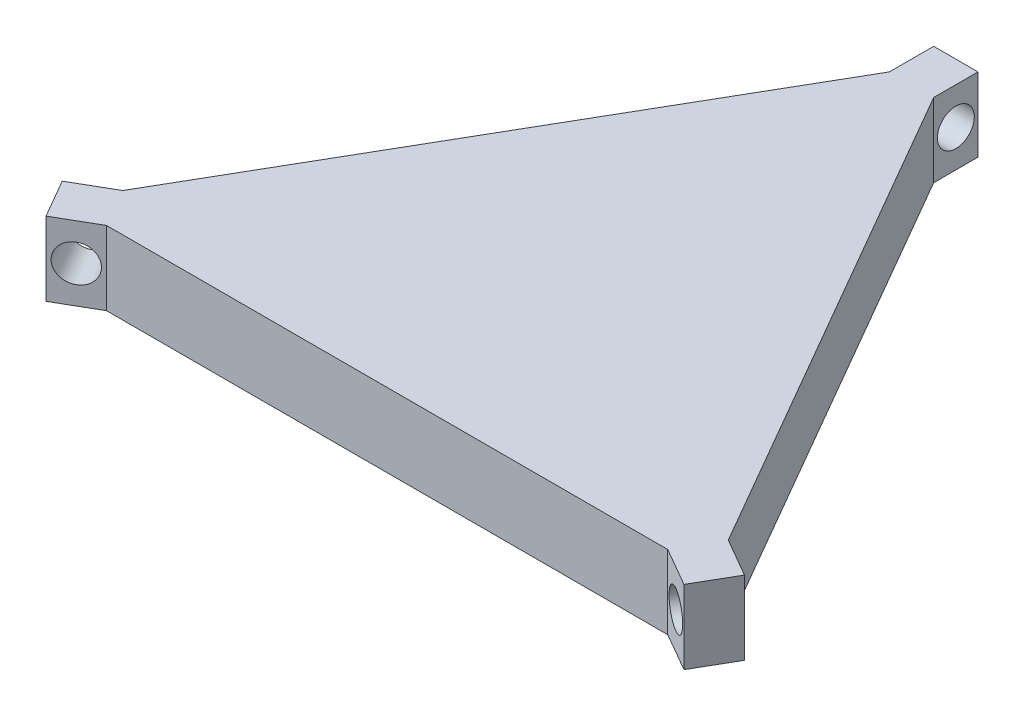
ISO-10303-21;
HEADER;
FILE_DESCRIPTION(('STEP AP214'),'2;1');
FILE_NAME('part.step','',(''),(''),'','','');
FILE_SCHEMA(('AUTOMOTIVE_DESIGN { 1 0 10303 214 1 1 1 1 }'));
ENDSEC;
DATA;
#1=APPLICATION_CONTEXT('core data for automotive mechanical design processes');
#2=APPLICATION_PROTOCOL_DEFINITION('international standard','automotive_design',2000,#1);
#3=PRODUCT_CONTEXT('',#1,'mechanical');
#4=PRODUCT('Part','Part','',(#3));
#5=PRODUCT_RELATED_PRODUCT_CATEGORY('part','',(#4));
#6=PRODUCT_DEFINITION_FORMATION('','',#4);
#7=PRODUCT_DEFINITION_CONTEXT('part definition',#1,'design');
#8=PRODUCT_DEFINITION('design','',#6,#7);
#9=PRODUCT_DEFINITION_SHAPE('','',#8);
#10=(LENGTH_UNIT() NAMED_UNIT(*) SI_UNIT(.MILLI.,.METRE.));
#11=(NAMED_UNIT(*) PLANE_ANGLE_UNIT() SI_UNIT($,.RADIAN.));
#12=(NAMED_UNIT(*) SI_UNIT($,.STERADIAN.) SOLID_ANGLE_UNIT());
#13=UNCERTAINTY_MEASURE_WITH_UNIT(LENGTH_MEASURE(1.E-05),#10,'distance_accuracy_value','');
#14=(GEOMETRIC_REPRESENTATION_CONTEXT(3) GLOBAL_UNCERTAINTY_ASSIGNED_CONTEXT((#13)) GLOBAL_UNIT_ASSIGNED_CONTEXT((#10,
#11,#12)) REPRESENTATION_CONTEXT('',''));
#15=CARTESIAN_POINT('',(0.,0.,0.));
#16=DIRECTION('',(0.,0.,1.));
#17=DIRECTION('',(1.,0.,0.));
#18=AXIS2_PLACEMENT_3D('',#15,#16,#17);
#19=CARTESIAN_POINT('',(-46.1961524226872,10.,-2.1961524227179));
#20=DIRECTION('',(0.866025403786309,0.,-0.499999999996761));
#21=DIRECTION('',(-0.499999999996761,0.,-0.866025403786309));
#22=AXIS2_PLACEMENT_3D('',#19,#20,#21);
#23=PLANE('',#22);
#24=DIRECTION('',(0.499999999996761,0.,0.866025403786309));
#25=VECTOR('',#24,1.);
#26=CARTESIAN_POINT('',(-46.1961524226872,0.,-2.1961524227179));
#27=LINE('',#26,#25);
#28=CARTESIAN_POINT('',(-46.1961524226872,0.,-2.1961524227179));
#29=VERTEX_POINT('',#28);
#30=CARTESIAN_POINT('',(-43.1961524227067,0.,2.99999999999995));
#31=VERTEX_POINT('',#30);
#32=EDGE_CURVE('E171',#29,#31,#27,.T.);
#33=ORIENTED_EDGE('',*,*,#32,.T.);
#34=DIRECTION('',(0.,-1.,0.));
#35=VECTOR('',#34,1.);
#36=CARTESIAN_POINT('',(-43.1961524227067,10.,2.99999999999995));
#37=LINE('',#36,#35);
#38=CARTESIAN_POINT('',(-43.1961524227067,10.,2.99999999999995));
#39=VERTEX_POINT('',#38);
#40=EDGE_CURVE('E11',#39,#31,#37,.T.);
#41=ORIENTED_EDGE('',*,*,#40,.F.);
#42=DIRECTION('',(0.499999999996761,0.,0.866025403786309));
#43=VECTOR('',#42,1.);
#44=CARTESIAN_POINT('',(-46.1961524226872,10.,-2.1961524227179));
#45=LINE('',#44,#43);
#46=CARTESIAN_POINT('',(-46.1961524226872,10.,-2.1961524227179));
#47=VERTEX_POINT('',#46);
#48=EDGE_CURVE('E206',#47,#39,#45,.T.);
#49=ORIENTED_EDGE('',*,*,#48,.F.);
#50=DIRECTION('',(0.,-1.,0.));
#51=VECTOR('',#50,1.);
#52=CARTESIAN_POINT('',(-46.1961524226872,10.,-2.1961524227179));
#53=LINE('',#52,#51);
#54=EDGE_CURVE('E167',#47,#29,#53,.T.);
#55=ORIENTED_EDGE('',*,*,#54,.T.);
#56=EDGE_LOOP('',(#33,#41,#49,#55));
#57=FACE_BOUND('',#56,.T.);
#58=ADVANCED_FACE('F45',(#57),#23,.F.);
#59=CARTESIAN_POINT('',(-38.,10.,0.));
#60=DIRECTION('',(-0.499999999999992,0.,-0.866025403784443));
#61=DIRECTION('',(-0.866025403784443,0.,0.499999999999992));
#62=AXIS2_PLACEMENT_3D('',#59,#60,#61);
#63=PLANE('',#62);
#64=CARTESIAN_POINT('',(-40.5980762113533,5.,1.49999999999998));
#65=DIRECTION('',(0.499999999999992,0.,0.866025403784443));
#66=DIRECTION('',(0.866025403784443,0.,-0.499999999999992));
#67=AXIS2_PLACEMENT_3D('',#64,#65,#66);
#68=CIRCLE('',#67,2.5);
#69=CARTESIAN_POINT('',(-38.4330127018922,5.,0.249999999999997));
#70=VERTEX_POINT('',#69);
#71=EDGE_CURVE('E354',#70,#70,#68,.T.);
#72=ORIENTED_EDGE('',*,*,#71,.F.);
#73=EDGE_LOOP('',(#72));
#74=FACE_BOUND('',#73,.T.);
#75=DIRECTION('',(0.866025403784443,0.,-0.499999999999992));
#76=VECTOR('',#75,1.);
#77=CARTESIAN_POINT('',(-38.,0.,0.));
#78=LINE('',#77,#76);
#79=CARTESIAN_POINT('',(-38.,0.,0.));
#80=VERTEX_POINT('',#79);
#81=EDGE_CURVE('E175',#31,#80,#78,.T.);
#82=ORIENTED_EDGE('',*,*,#81,.T.);
#83=DIRECTION('',(0.,-1.,0.));
#84=VECTOR('',#83,1.);
#85=CARTESIAN_POINT('',(-38.,10.,0.));
#86=LINE('',#85,#84);
#87=CARTESIAN_POINT('',(-38.,10.,0.));
#88=VERTEX_POINT('',#87);
#89=EDGE_CURVE('E55',#88,#80,#86,.T.);
#90=ORIENTED_EDGE('',*,*,#89,.F.);
#91=DIRECTION('',(0.866025403784443,0.,-0.499999999999992));
#92=VECTOR('',#91,1.);
#93=CARTESIAN_POINT('',(-38.,10.,0.));
#94=LINE('',#93,#92);
#95=EDGE_CURVE('E118',#39,#88,#94,.T.);
#96=ORIENTED_EDGE('',*,*,#95,.F.);
#97=ORIENTED_EDGE('',*,*,#40,.T.);
#98=EDGE_LOOP('',(#82,#90,#96,#97));
#99=FACE_BOUND('',#98,.T.);
#100=ADVANCED_FACE('F305',(#74,#99),#63,.F.);
#101=CARTESIAN_POINT('',(-38.,10.,0.));
#102=DIRECTION('',(0.,0.,-1.));
#103=DIRECTION('',(-1.,0.,0.));
#104=AXIS2_PLACEMENT_3D('',#101,#102,#103);
#105=PLANE('',#104);
#106=DIRECTION('',(1.,0.,0.));
#107=VECTOR('',#106,1.);
#108=CARTESIAN_POINT('',(-38.,0.,0.));
#109=LINE('',#108,#107);
#110=CARTESIAN_POINT('',(38.,0.,0.));
#111=VERTEX_POINT('',#110);
#112=EDGE_CURVE('E179',#80,#111,#109,.T.);
#113=ORIENTED_EDGE('',*,*,#112,.T.);
#114=DIRECTION('',(0.,-1.,0.));
#115=VECTOR('',#114,1.);
#116=CARTESIAN_POINT('',(38.,10.,0.));
#117=LINE('',#116,#115);
#118=CARTESIAN_POINT('',(38.,10.,0.));
#119=VERTEX_POINT('',#118);
#120=EDGE_CURVE('E233',#119,#111,#117,.T.);
#121=ORIENTED_EDGE('',*,*,#120,.F.);
#122=DIRECTION('',(1.,0.,0.));
#123=VECTOR('',#122,1.);
#124=CARTESIAN_POINT('',(-38.,10.,0.));
#125=LINE('',#124,#123);
#126=EDGE_CURVE('E244',#88,#119,#125,.T.);
#127=ORIENTED_EDGE('',*,*,#126,.F.);
#128=ORIENTED_EDGE('',*,*,#89,.T.);
#129=EDGE_LOOP('',(#113,#121,#127,#128));
#130=FACE_BOUND('',#129,.T.);
#131=ADVANCED_FACE('F242',(#130),#105,.F.);
#132=CARTESIAN_POINT('',(38.,10.,0.));
#133=DIRECTION('',(0.500000000000015,0.,-0.86602540378443));
#134=DIRECTION('',(-0.86602540378443,0.,-0.500000000000015));
#135=AXIS2_PLACEMENT_3D('',#132,#133,#134);
#136=PLANE('',#135);
#137=CARTESIAN_POINT('',(40.5980762113543,5.,1.49999999997292));
#138=DIRECTION('',(0.499999999999415,0.,-0.866025403784777));
#139=DIRECTION('',(-0.866025403784777,0.,-0.499999999999415));
#140=AXIS2_PLACEMENT_3D('',#137,#138,#139);
#141=CIRCLE('',#140,2.5);
#142=CARTESIAN_POINT('',(38.4330127018924,5.,0.249999999974379));
#143=VERTEX_POINT('',#142);
#144=EDGE_CURVE('E348',#143,#143,#141,.T.);
#145=ORIENTED_EDGE('',*,*,#144,.T.);
#146=EDGE_LOOP('',(#145));
#147=FACE_BOUND('',#146,.T.);
#148=DIRECTION('',(0.86602540378443,0.,0.500000000000015));
#149=VECTOR('',#148,1.);
#150=CARTESIAN_POINT('',(38.,0.,0.));
#151=LINE('',#150,#149);
#152=CARTESIAN_POINT('',(43.1961524227066,0.,3.00000000000009));
#153=VERTEX_POINT('',#152);
#154=EDGE_CURVE('E182',#111,#153,#151,.T.);
#155=ORIENTED_EDGE('',*,*,#154,.T.);
#156=DIRECTION('',(0.,-1.,0.));
#157=VECTOR('',#156,1.);
#158=CARTESIAN_POINT('',(43.1961524227066,10.,3.00000000000009));
#159=LINE('',#158,#157);
#160=CARTESIAN_POINT('',(43.1961524227066,10.,3.00000000000009));
#161=VERTEX_POINT('',#160);
#162=EDGE_CURVE('E229',#161,#153,#159,.T.);
#163=ORIENTED_EDGE('',*,*,#162,.F.);
#164=DIRECTION('',(0.86602540378443,0.,0.500000000000015));
#165=VECTOR('',#164,1.);
#166=CARTESIAN_POINT('',(38.,10.,0.));
#167=LINE('',#166,#165);
#168=EDGE_CURVE('E263',#119,#161,#167,.T.);
#169=ORIENTED_EDGE('',*,*,#168,.F.);
#170=ORIENTED_EDGE('',*,*,#120,.T.);
#171=EDGE_LOOP('',(#155,#163,#169,#170));
#172=FACE_BOUND('',#171,.T.);
#173=ADVANCED_FACE('F253',(#147,#172),#136,.F.);
#174=CARTESIAN_POINT('',(43.1961524227066,10.,3.00000000000009));
#175=DIRECTION('',(-0.866025403785571,0.,-0.49999999999804));
#176=DIRECTION('',(-0.49999999999804,0.,0.866025403785571));
#177=AXIS2_PLACEMENT_3D('',#174,#175,#176);
#178=PLANE('',#177);
#179=DIRECTION('',(0.49999999999804,0.,-0.866025403785571));
#180=VECTOR('',#179,1.);
#181=CARTESIAN_POINT('',(43.1961524227066,0.,3.00000000000009));
#182=LINE('',#181,#180);
#183=CARTESIAN_POINT('',(46.1961524226948,0.,-2.19615242271334));
#184=VERTEX_POINT('',#183);
#185=EDGE_CURVE('E185',#153,#184,#182,.T.);
#186=ORIENTED_EDGE('',*,*,#185,.T.);
#187=DIRECTION('',(0.,-1.,0.));
#188=VECTOR('',#187,1.);
#189=CARTESIAN_POINT('',(46.1961524226948,10.,-2.19615242271334));
#190=LINE('',#189,#188);
#191=CARTESIAN_POINT('',(46.1961524226948,10.,-2.19615242271334));
#192=VERTEX_POINT('',#191);
#193=EDGE_CURVE('E225',#192,#184,#190,.T.);
#194=ORIENTED_EDGE('',*,*,#193,.F.);
#195=DIRECTION('',(0.49999999999804,0.,-0.866025403785571));
#196=VECTOR('',#195,1.);
#197=CARTESIAN_POINT('',(43.1961524227066,10.,3.00000000000009));
#198=LINE('',#197,#196);
#199=EDGE_CURVE('E259',#161,#192,#198,.T.);
#200=ORIENTED_EDGE('',*,*,#199,.F.);
#201=ORIENTED_EDGE('',*,*,#162,.T.);
#202=EDGE_LOOP('',(#186,#194,#200,#201));
#203=FACE_BOUND('',#202,.T.);
#204=ADVANCED_FACE('F257',(#203),#178,.F.);
#205=CARTESIAN_POINT('',(40.9999999999912,10.,-5.19615242271852));
#206=DIRECTION('',(-0.500000000000863,0.,0.86602540378394));
#207=DIRECTION('',(0.86602540378394,0.,0.500000000000863));
#208=AXIS2_PLACEMENT_3D('',#205,#206,#207);
#209=PLANE('',#208);
#210=CARTESIAN_POINT('',(43.5980762113403,5.,-3.69615242271749));
#211=DIRECTION('',(-0.500000000000863,0.,0.86602540378394));
#212=DIRECTION('',(0.86602540378394,0.,0.500000000000863));
#213=AXIS2_PLACEMENT_3D('',#210,#211,#212);
#214=CIRCLE('',#213,2.5);
#215=CARTESIAN_POINT('',(45.7631397208001,5.,-2.44615242271534));
#216=VERTEX_POINT('',#215);
#217=EDGE_CURVE('E48',#216,#216,#214,.F.);
#218=ORIENTED_EDGE('',*,*,#217,.F.);
#219=EDGE_LOOP('',(#218));
#220=FACE_BOUND('',#219,.T.);
#221=DIRECTION('',(-0.86602540378394,0.,-0.500000000000863));
#222=VECTOR('',#221,1.);
#223=CARTESIAN_POINT('',(40.9999999999912,0.,-5.19615242271852));
#224=LINE('',#223,#222);
#225=CARTESIAN_POINT('',(40.9999999999912,0.,-5.19615242271852));
#226=VERTEX_POINT('',#225);
#227=EDGE_CURVE('E188',#184,#226,#224,.T.);
#228=ORIENTED_EDGE('',*,*,#227,.T.);
#229=DIRECTION('',(0.,-1.,0.));
#230=VECTOR('',#229,1.);
#231=CARTESIAN_POINT('',(40.9999999999912,10.,-5.19615242271852));
#232=LINE('',#231,#230);
#233=CARTESIAN_POINT('',(40.9999999999912,10.,-5.19615242271852));
#234=VERTEX_POINT('',#233);
#235=EDGE_CURVE('E221',#234,#226,#232,.T.);
#236=ORIENTED_EDGE('',*,*,#235,.F.);
#237=DIRECTION('',(-0.86602540378394,0.,-0.500000000000863));
#238=VECTOR('',#237,1.);
#239=CARTESIAN_POINT('',(40.9999999999912,10.,-5.19615242271852));
#240=LINE('',#239,#238);
#241=EDGE_CURVE('E262',#192,#234,#240,.T.);
#242=ORIENTED_EDGE('',*,*,#241,.F.);
#243=ORIENTED_EDGE('',*,*,#193,.T.);
#244=EDGE_LOOP('',(#228,#236,#242,#243));
#245=FACE_BOUND('',#244,.T.);
#246=ADVANCED_FACE('F321',(#220,#245),#209,.F.);
#247=CARTESIAN_POINT('',(3.00000000005854,10.,-71.0140831103748));
#248=DIRECTION('',(-0.86602540378495,0.,0.499999999999114));
#249=DIRECTION('',(0.499999999999114,0.,0.86602540378495));
#250=AXIS2_PLACEMENT_3D('',#247,#248,#249);
#251=PLANE('',#250);
#252=DIRECTION('',(-0.499999999999114,0.,-0.86602540378495));
#253=VECTOR('',#252,1.);
#254=CARTESIAN_POINT('',(3.00000000005854,0.,-71.0140831103748));
#255=LINE('',#254,#253);
#256=CARTESIAN_POINT('',(3.00000000005854,0.,-71.0140831103748));
#257=VERTEX_POINT('',#256);
#258=EDGE_CURVE('E191',#226,#257,#255,.T.);
#259=ORIENTED_EDGE('',*,*,#258,.T.);
#260=DIRECTION('',(0.,-1.,0.));
#261=VECTOR('',#260,1.);
#262=CARTESIAN_POINT('',(3.00000000005854,10.,-71.0140831103748));
#263=LINE('',#262,#261);
#264=CARTESIAN_POINT('',(3.00000000005854,10.,-71.0140831103748));
#265=VERTEX_POINT('',#264);
#266=EDGE_CURVE('E217',#265,#257,#263,.T.);
#267=ORIENTED_EDGE('',*,*,#266,.F.);
#268=DIRECTION('',(-0.499999999999114,0.,-0.86602540378495));
#269=VECTOR('',#268,1.);
#270=CARTESIAN_POINT('',(3.00000000005854,10.,-71.0140831103748));
#271=LINE('',#270,#269);
#272=EDGE_CURVE('E267',#234,#265,#271,.T.);
#273=ORIENTED_EDGE('',*,*,#272,.F.);
#274=ORIENTED_EDGE('',*,*,#235,.T.);
#275=EDGE_LOOP('',(#259,#267,#273,#274));
#276=FACE_BOUND('',#275,.T.);
#277=ADVANCED_FACE('F324',(#276),#251,.F.);
#278=CARTESIAN_POINT('',(3.00000000005854,10.,-71.0140831103748));
#279=DIRECTION('',(-1.,0.,1.32278447454818E-11));
#280=DIRECTION('',(1.32278447454818E-11,0.,1.));
#281=AXIS2_PLACEMENT_3D('',#278,#279,#280);
#282=PLANE('',#281);
#283=CARTESIAN_POINT('',(3.00000000001885,5.,-74.0140831103366));
#284=DIRECTION('',(-1.,0.,1.32278447454818E-11));
#285=DIRECTION('',(1.32278447454818E-11,0.,1.));
#286=AXIS2_PLACEMENT_3D('',#283,#284,#285);
#287=CIRCLE('',#286,2.5);
#288=CARTESIAN_POINT('',(3.00000000005192,5.,-71.5140831103366));
#289=VERTEX_POINT('',#288);
#290=EDGE_CURVE('E344',#289,#289,#287,.F.);
#291=ORIENTED_EDGE('',*,*,#290,.F.);
#292=EDGE_LOOP('',(#291));
#293=FACE_BOUND('',#292,.T.);
#294=DIRECTION('',(-1.32278447454818E-11,0.,-1.));
#295=VECTOR('',#294,1.);
#296=CARTESIAN_POINT('',(3.00000000005854,0.,-71.0140831103748));
#297=LINE('',#296,#295);
#298=CARTESIAN_POINT('',(2.99999999997917,0.,-77.0140831103748));
#299=VERTEX_POINT('',#298);
#300=EDGE_CURVE('E194',#257,#299,#297,.T.);
#301=ORIENTED_EDGE('',*,*,#300,.T.);
#302=DIRECTION('',(0.,-1.,0.));
#303=VECTOR('',#302,1.);
#304=CARTESIAN_POINT('',(2.99999999997917,10.,-77.0140831103748));
#305=LINE('',#304,#303);
#306=CARTESIAN_POINT('',(2.99999999997917,10.,-77.0140831103748));
#307=VERTEX_POINT('',#306);
#308=EDGE_CURVE('E213',#307,#299,#305,.T.);
#309=ORIENTED_EDGE('',*,*,#308,.F.);
#310=DIRECTION('',(-1.32278447454818E-11,0.,-1.));
#311=VECTOR('',#310,1.);
#312=CARTESIAN_POINT('',(3.00000000005854,10.,-71.0140831103748));
#313=LINE('',#312,#311);
#314=EDGE_CURVE('E274',#265,#307,#313,.T.);
#315=ORIENTED_EDGE('',*,*,#314,.F.);
#316=ORIENTED_EDGE('',*,*,#266,.T.);
#317=EDGE_LOOP('',(#301,#309,#315,#316));
#318=FACE_BOUND('',#317,.T.);
#319=ADVANCED_FACE('F282',(#293,#318),#282,.F.);
#320=CARTESIAN_POINT('',(2.99999999997917,10.,-77.0140831103748));
#321=DIRECTION('',(6.26119526595896E-12,0.,1.));
#322=DIRECTION('',(1.,0.,-6.26119526595896E-12));
#323=AXIS2_PLACEMENT_3D('',#320,#321,#322);
#324=PLANE('',#323);
#325=DIRECTION('',(-1.,0.,6.26119526595896E-12));
#326=VECTOR('',#325,1.);
#327=CARTESIAN_POINT('',(2.99999999997917,0.,-77.0140831103748));
#328=LINE('',#327,#326);
#329=CARTESIAN_POINT('',(-3.00000000002083,0.,-77.0140831103372));
#330=VERTEX_POINT('',#329);
#331=EDGE_CURVE('E197',#299,#330,#328,.T.);
#332=ORIENTED_EDGE('',*,*,#331,.T.);
#333=DIRECTION('',(0.,-1.,0.));
#334=VECTOR('',#333,1.);
#335=CARTESIAN_POINT('',(-3.00000000002083,10.,-77.0140831103372));
#336=LINE('',#335,#334);
#337=CARTESIAN_POINT('',(-3.00000000002083,10.,-77.0140831103372));
#338=VERTEX_POINT('',#337);
#339=EDGE_CURVE('E160',#338,#330,#336,.T.);
#340=ORIENTED_EDGE('',*,*,#339,.F.);
#341=DIRECTION('',(-1.,0.,6.26119526595896E-12));
#342=VECTOR('',#341,1.);
#343=CARTESIAN_POINT('',(2.99999999997917,10.,-77.0140831103748));
#344=LINE('',#343,#342);
#345=EDGE_CURVE('E149',#307,#338,#344,.T.);
#346=ORIENTED_EDGE('',*,*,#345,.F.);
#347=ORIENTED_EDGE('',*,*,#308,.T.);
#348=EDGE_LOOP('',(#332,#340,#346,#347));
#349=FACE_BOUND('',#348,.T.);
#350=ADVANCED_FACE('F286',(#349),#324,.F.);
#351=CARTESIAN_POINT('',(-2.99999999998328,10.,-71.0140831103372));
#352=DIRECTION('',(1.,0.,-6.2588100211795E-12));
#353=DIRECTION('',(-6.2588100211795E-12,0.,-1.));
#354=AXIS2_PLACEMENT_3D('',#351,#352,#353);
#355=PLANE('',#354);
#356=CARTESIAN_POINT('',(-2.99999999953089,5.,-74.0140831103372));
#357=DIRECTION('',(-1.,0.,-1.07119174641568E-13));
#358=DIRECTION('',(-1.07119174641568E-13,0.,1.));
#359=AXIS2_PLACEMENT_3D('',#356,#357,#358);
#360=CIRCLE('',#359,2.5);
#361=CARTESIAN_POINT('',(-2.99999999953115,5.,-71.5140831103372));
#362=VERTEX_POINT('',#361);
#363=EDGE_CURVE('E341',#362,#362,#360,.T.);
#364=ORIENTED_EDGE('',*,*,#363,.F.);
#365=EDGE_LOOP('',(#364));
#366=FACE_BOUND('',#365,.T.);
#367=DIRECTION('',(6.2588100211795E-12,0.,1.));
#368=VECTOR('',#367,1.);
#369=CARTESIAN_POINT('',(-2.99999999998328,0.,-71.0140831103372));
#370=LINE('',#369,#368);
#371=CARTESIAN_POINT('',(-2.99999999998328,0.,-71.0140831103372));
#372=VERTEX_POINT('',#371);
#373=EDGE_CURVE('E158',#330,#372,#370,.T.);
#374=ORIENTED_EDGE('',*,*,#373,.T.);
#375=DIRECTION('',(0.,-1.,0.));
#376=VECTOR('',#375,1.);
#377=CARTESIAN_POINT('',(-2.99999999998328,10.,-71.0140831103372));
#378=LINE('',#377,#376);
#379=CARTESIAN_POINT('',(-2.99999999998328,10.,-71.0140831103372));
#380=VERTEX_POINT('',#379);
#381=EDGE_CURVE('E155',#380,#372,#378,.T.);
#382=ORIENTED_EDGE('',*,*,#381,.F.);
#383=DIRECTION('',(6.2588100211795E-12,0.,1.));
#384=VECTOR('',#383,1.);
#385=CARTESIAN_POINT('',(-2.99999999998328,10.,-71.0140831103372));
#386=LINE('',#385,#384);
#387=EDGE_CURVE('E143',#338,#380,#386,.T.);
#388=ORIENTED_EDGE('',*,*,#387,.F.);
#389=ORIENTED_EDGE('',*,*,#339,.T.);
#390=EDGE_LOOP('',(#374,#382,#388,#389));
#391=FACE_BOUND('',#390,.T.);
#392=ADVANCED_FACE('F156',(#366,#391),#355,.F.);
#393=CARTESIAN_POINT('',(-2.99999999998328,10.,-71.0140831103372));
#394=DIRECTION('',(0.866025403784456,0.,0.499999999999969));
#395=DIRECTION('',(0.499999999999969,0.,-0.866025403784456));
#396=AXIS2_PLACEMENT_3D('',#393,#394,#395);
#397=PLANE('',#396);
#398=DIRECTION('',(-0.499999999999969,0.,0.866025403784456));
#399=VECTOR('',#398,1.);
#400=CARTESIAN_POINT('',(-2.99999999998328,0.,-71.0140831103372));
#401=LINE('',#400,#399);
#402=CARTESIAN_POINT('',(-40.999999999981,0.,-5.19615242271852));
#403=VERTEX_POINT('',#402);
#404=EDGE_CURVE('E104',#372,#403,#401,.T.);
#405=ORIENTED_EDGE('',*,*,#404,.T.);
#406=DIRECTION('',(0.,-1.,0.));
#407=VECTOR('',#406,1.);
#408=CARTESIAN_POINT('',(-40.999999999981,10.,-5.19615242271852));
#409=LINE('',#408,#407);
#410=CARTESIAN_POINT('',(-40.999999999981,10.,-5.19615242271852));
#411=VERTEX_POINT('',#410);
#412=EDGE_CURVE('E161',#411,#403,#409,.T.);
#413=ORIENTED_EDGE('',*,*,#412,.F.);
#414=DIRECTION('',(-0.499999999999969,0.,0.866025403784456));
#415=VECTOR('',#414,1.);
#416=CARTESIAN_POINT('',(-2.99999999998328,10.,-71.0140831103372));
#417=LINE('',#416,#415);
#418=EDGE_CURVE('E147',#380,#411,#417,.T.);
#419=ORIENTED_EDGE('',*,*,#418,.F.);
#420=ORIENTED_EDGE('',*,*,#381,.T.);
#421=EDGE_LOOP('',(#405,#413,#419,#420));
#422=FACE_BOUND('',#421,.T.);
#423=ADVANCED_FACE('F163',(#422),#397,.F.);
#424=CARTESIAN_POINT('',(-40.999999999981,10.,-5.19615242271852));
#425=DIRECTION('',(0.500000000000103,0.,0.866025403784379));
#426=DIRECTION('',(0.866025403784379,0.,-0.500000000000103));
#427=AXIS2_PLACEMENT_3D('',#424,#425,#426);
#428=PLANE('',#427);
#429=CARTESIAN_POINT('',(-43.5980762113535,5.,-3.69615242270701));
#430=DIRECTION('',(0.500000000000103,0.,0.866025403784379));
#431=DIRECTION('',(0.866025403784379,0.,-0.500000000000103));
#432=AXIS2_PLACEMENT_3D('',#429,#430,#431);
#433=CIRCLE('',#432,2.5);
#434=CARTESIAN_POINT('',(-41.4330127018925,5.,-4.94615242270727));
#435=VERTEX_POINT('',#434);
#436=EDGE_CURVE('E176',#435,#435,#433,.F.);
#437=ORIENTED_EDGE('',*,*,#436,.F.);
#438=EDGE_LOOP('',(#437));
#439=FACE_BOUND('',#438,.T.);
#440=DIRECTION('',(-0.866025403784379,0.,0.500000000000103));
#441=VECTOR('',#440,1.);
#442=CARTESIAN_POINT('',(-40.999999999981,0.,-5.19615242271852));
#443=LINE('',#442,#441);
#444=EDGE_CURVE('E110',#403,#29,#443,.T.);
#445=ORIENTED_EDGE('',*,*,#444,.T.);
#446=ORIENTED_EDGE('',*,*,#54,.F.);
#447=DIRECTION('',(-0.866025403784379,0.,0.500000000000103));
#448=VECTOR('',#447,1.);
#449=CARTESIAN_POINT('',(-40.999999999981,10.,-5.19615242271852));
#450=LINE('',#449,#448);
#451=EDGE_CURVE('E63',#411,#47,#450,.T.);
#452=ORIENTED_EDGE('',*,*,#451,.F.);
#453=ORIENTED_EDGE('',*,*,#412,.T.);
#454=EDGE_LOOP('',(#445,#446,#452,#453));
#455=FACE_BOUND('',#454,.T.);
#456=ADVANCED_FACE('F290',(#439,#455),#428,.F.);
#457=CARTESIAN_POINT('',(0.,10.,0.));
#458=DIRECTION('',(0.,-1.,0.));
#459=DIRECTION('',(0.,0.,-1.));
#460=AXIS2_PLACEMENT_3D('',#457,#458,#459);
#461=PLANE('',#460);
#462=ORIENTED_EDGE('',*,*,#48,.T.);
#463=ORIENTED_EDGE('',*,*,#95,.T.);
#464=ORIENTED_EDGE('',*,*,#126,.T.);
#465=ORIENTED_EDGE('',*,*,#168,.T.);
#466=ORIENTED_EDGE('',*,*,#199,.T.);
#467=ORIENTED_EDGE('',*,*,#241,.T.);
#468=ORIENTED_EDGE('',*,*,#272,.T.);
#469=ORIENTED_EDGE('',*,*,#314,.T.);
#470=ORIENTED_EDGE('',*,*,#345,.T.);
#471=ORIENTED_EDGE('',*,*,#387,.T.);
#472=ORIENTED_EDGE('',*,*,#418,.T.);
#473=ORIENTED_EDGE('',*,*,#451,.T.);
#474=EDGE_LOOP('',(#462,#463,#464,#465,#466,#467,#468,#469,#470,#471,#472,#473));
#475=FACE_BOUND('',#474,.T.);
#476=ADVANCED_FACE('F145',(#475),#461,.F.);
#477=CARTESIAN_POINT('',(0.,0.,0.));
#478=DIRECTION('',(0.,-1.,0.));
#479=DIRECTION('',(0.,0.,-1.));
#480=AXIS2_PLACEMENT_3D('',#477,#478,#479);
#481=PLANE('',#480);
#482=ORIENTED_EDGE('',*,*,#32,.F.);
#483=ORIENTED_EDGE('',*,*,#444,.F.);
#484=ORIENTED_EDGE('',*,*,#404,.F.);
#485=ORIENTED_EDGE('',*,*,#373,.F.);
#486=ORIENTED_EDGE('',*,*,#331,.F.);
#487=ORIENTED_EDGE('',*,*,#300,.F.);
#488=ORIENTED_EDGE('',*,*,#258,.F.);
#489=ORIENTED_EDGE('',*,*,#227,.F.);
#490=ORIENTED_EDGE('',*,*,#185,.F.);
#491=ORIENTED_EDGE('',*,*,#154,.F.);
#492=ORIENTED_EDGE('',*,*,#112,.F.);
#493=ORIENTED_EDGE('',*,*,#81,.F.);
#494=EDGE_LOOP('',(#482,#483,#484,#485,#486,#487,#488,#489,#490,#491,#492,#493));
#495=FACE_BOUND('',#494,.T.);
#496=ADVANCED_FACE('F248',(#495),#481,.T.);
#497=CARTESIAN_POINT('',(-47.1336101172862,5.,-9.81987677966499));
#498=DIRECTION('',(0.499999999999992,0.,0.866025403784443));
#499=DIRECTION('',(0.866025403784443,0.,-0.499999999999992));
#500=AXIS2_PLACEMENT_3D('',#497,#498,#499);
#501=CYLINDRICAL_SURFACE('',#500,2.5);
#502=ORIENTED_EDGE('',*,*,#436,.T.);
#503=EDGE_LOOP('',(#502));
#504=FACE_BOUND('',#503,.T.);
#505=ORIENTED_EDGE('',*,*,#71,.T.);
#506=EDGE_LOOP('',(#505));
#507=FACE_BOUND('',#506,.T.);
#508=ADVANCED_FACE('F375',(#504,#507),#501,.F.);
#509=CARTESIAN_POINT('',(92.4994532814834,5.,-88.3958220684213));
#510=DIRECTION('',(-0.499999999999415,0.,0.866025403784777));
#511=DIRECTION('',(0.866025403784777,0.,0.499999999999415));
#512=AXIS2_PLACEMENT_3D('',#509,#510,#511);
#513=CYLINDRICAL_SURFACE('',#512,2.5);
#514=ORIENTED_EDGE('',*,*,#144,.F.);
#515=EDGE_LOOP('',(#514));
#516=FACE_BOUND('',#515,.T.);
#517=ORIENTED_EDGE('',*,*,#217,.T.);
#518=EDGE_LOOP('',(#517));
#519=FACE_BOUND('',#518,.T.);
#520=ADVANCED_FACE('F369',(#516,#519),#513,.F.);
#521=CARTESIAN_POINT('',(10.0710678118846,5.,-74.0140831103358));
#522=DIRECTION('',(-1.,0.,-1.07119174641568E-13));
#523=DIRECTION('',(-1.07119174641568E-13,0.,1.));
#524=AXIS2_PLACEMENT_3D('',#521,#522,#523);
#525=CYLINDRICAL_SURFACE('',#524,2.5);
#526=ORIENTED_EDGE('',*,*,#290,.T.);
#527=EDGE_LOOP('',(#526));
#528=FACE_BOUND('',#527,.T.);
#529=ORIENTED_EDGE('',*,*,#363,.T.);
#530=EDGE_LOOP('',(#529));
#531=FACE_BOUND('',#530,.T.);
#532=ADVANCED_FACE('F374',(#528,#531),#525,.F.);
#533=CLOSED_SHELL('',(#58,#100,#131,#173,#204,#246,#277,#319,#350,#392,#423,#456,#476,#496,#508,
#520,#532));
#534=MANIFOLD_SOLID_BREP('B2',#533);
#535=ADVANCED_BREP_SHAPE_REPRESENTATION('',(#18,#534),#14);
#536=SHAPE_DEFINITION_REPRESENTATION(#9,#535);
ENDSEC;
END-ISO-10303-21;
